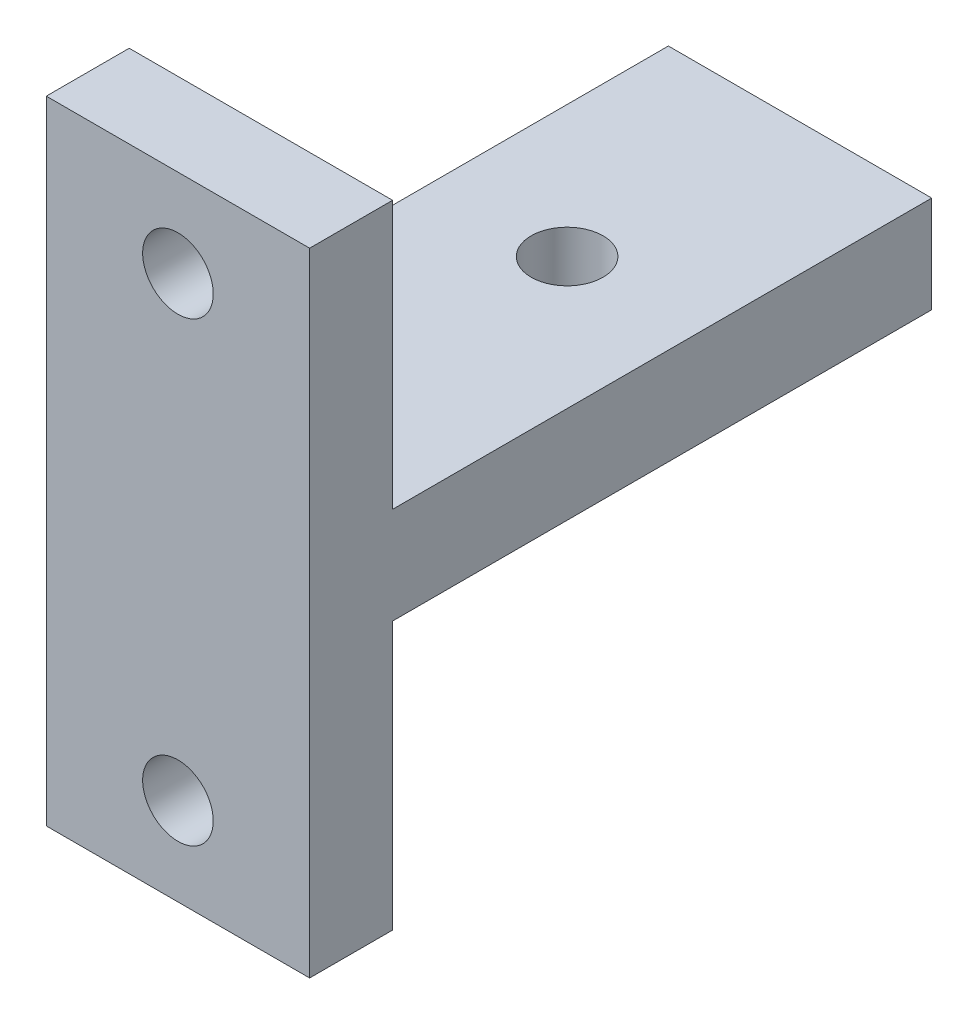
ISO-10303-21;
HEADER;
FILE_DESCRIPTION(('STEP AP214'),'2;1');
FILE_NAME('part.step','',(''),(''),'','','');
FILE_SCHEMA(('AUTOMOTIVE_DESIGN { 1 0 10303 214 1 1 1 1 }'));
ENDSEC;
DATA;
#1=APPLICATION_CONTEXT('core data for automotive mechanical design processes');
#2=APPLICATION_PROTOCOL_DEFINITION('international standard','automotive_design',2000,#1);
#3=PRODUCT_CONTEXT('',#1,'mechanical');
#4=PRODUCT('Part','Part','',(#3));
#5=PRODUCT_RELATED_PRODUCT_CATEGORY('part','',(#4));
#6=PRODUCT_DEFINITION_FORMATION('','',#4);
#7=PRODUCT_DEFINITION_CONTEXT('part definition',#1,'design');
#8=PRODUCT_DEFINITION('design','',#6,#7);
#9=PRODUCT_DEFINITION_SHAPE('','',#8);
#10=(LENGTH_UNIT() NAMED_UNIT(*) SI_UNIT(.MILLI.,.METRE.));
#11=(NAMED_UNIT(*) PLANE_ANGLE_UNIT() SI_UNIT($,.RADIAN.));
#12=(NAMED_UNIT(*) SI_UNIT($,.STERADIAN.) SOLID_ANGLE_UNIT());
#13=UNCERTAINTY_MEASURE_WITH_UNIT(LENGTH_MEASURE(1.E-05),#10,'distance_accuracy_value','');
#14=(GEOMETRIC_REPRESENTATION_CONTEXT(3) GLOBAL_UNCERTAINTY_ASSIGNED_CONTEXT((#13)) GLOBAL_UNIT_ASSIGNED_CONTEXT((#10,
#11,#12)) REPRESENTATION_CONTEXT('',''));
#15=CARTESIAN_POINT('',(0.,0.,0.));
#16=DIRECTION('',(0.,0.,1.));
#17=DIRECTION('',(1.,0.,0.));
#18=AXIS2_PLACEMENT_3D('',#15,#16,#17);
#19=CARTESIAN_POINT('',(0.,0.,-6.));
#20=DIRECTION('',(0.,0.,1.));
#21=DIRECTION('',(1.,0.,0.));
#22=AXIS2_PLACEMENT_3D('',#19,#20,#21);
#23=PLANE('',#22);
#24=CARTESIAN_POINT('',(0.,-16.51,-6.));
#25=DIRECTION('',(0.,0.,1.));
#26=DIRECTION('',(1.,0.,0.));
#27=AXIS2_PLACEMENT_3D('',#24,#25,#26);
#28=CIRCLE('',#27,2.5527);
#29=CARTESIAN_POINT('',(2.55269999999999,-16.51,-6.));
#30=VERTEX_POINT('',#29);
#31=EDGE_CURVE('E170',#30,#30,#28,.F.);
#32=ORIENTED_EDGE('',*,*,#31,.F.);
#33=EDGE_LOOP('',(#32));
#34=FACE_BOUND('',#33,.T.);
#35=DIRECTION('',(0.,1.,0.));
#36=VECTOR('',#35,1.);
#37=CARTESIAN_POINT('',(-9.525,0.,-6.));
#38=LINE('',#37,#36);
#39=CARTESIAN_POINT('',(-9.525,-22.86,-6.));
#40=VERTEX_POINT('',#39);
#41=CARTESIAN_POINT('',(-9.525,-3.5,-6.00000000000001));
#42=VERTEX_POINT('',#41);
#43=EDGE_CURVE('E160',#40,#42,#38,.T.);
#44=ORIENTED_EDGE('',*,*,#43,.T.);
#45=DIRECTION('',(1.,0.,0.));
#46=VECTOR('',#45,1.);
#47=CARTESIAN_POINT('',(0.,-3.5,-6.));
#48=LINE('',#47,#46);
#49=CARTESIAN_POINT('',(9.525,-3.5,-6.00000000000001));
#50=VERTEX_POINT('',#49);
#51=EDGE_CURVE('E152',#42,#50,#48,.T.);
#52=ORIENTED_EDGE('',*,*,#51,.T.);
#53=DIRECTION('',(0.,1.,0.));
#54=VECTOR('',#53,1.);
#55=CARTESIAN_POINT('',(9.525,0.,-6.));
#56=LINE('',#55,#54);
#57=CARTESIAN_POINT('',(9.525,-22.86,-6.));
#58=VERTEX_POINT('',#57);
#59=EDGE_CURVE('E166',#58,#50,#56,.T.);
#60=ORIENTED_EDGE('',*,*,#59,.F.);
#61=DIRECTION('',(1.,0.,0.));
#62=VECTOR('',#61,1.);
#63=CARTESIAN_POINT('',(0.,-22.86,-6.));
#64=LINE('',#63,#62);
#65=EDGE_CURVE('E163',#40,#58,#64,.T.);
#66=ORIENTED_EDGE('',*,*,#65,.F.);
#67=EDGE_LOOP('',(#44,#52,#60,#66));
#68=FACE_BOUND('',#67,.T.);
#69=ADVANCED_FACE('F38',(#34,#68),#23,.F.);
#70=CARTESIAN_POINT('',(-9.525,0.,-6.));
#71=DIRECTION('',(1.,0.,0.));
#72=DIRECTION('',(0.,0.,-1.));
#73=AXIS2_PLACEMENT_3D('',#70,#71,#72);
#74=PLANE('',#73);
#75=CARTESIAN_POINT('',(-9.525,3.5,-6.));
#76=VERTEX_POINT('',#75);
#77=CARTESIAN_POINT('',(-9.525,22.86,-6.));
#78=VERTEX_POINT('',#77);
#79=EDGE_CURVE('E63',#76,#78,#38,.T.);
#80=ORIENTED_EDGE('',*,*,#79,.F.);
#81=DIRECTION('',(0.,0.,1.));
#82=VECTOR('',#81,1.);
#83=CARTESIAN_POINT('',(-9.525,3.5,-45.));
#84=LINE('',#83,#82);
#85=CARTESIAN_POINT('',(-9.525,3.5,-45.));
#86=VERTEX_POINT('',#85);
#87=EDGE_CURVE('E55',#86,#76,#84,.T.);
#88=ORIENTED_EDGE('',*,*,#87,.F.);
#89=DIRECTION('',(0.,-1.,0.));
#90=VECTOR('',#89,1.);
#91=CARTESIAN_POINT('',(-9.525,-3.5,-45.));
#92=LINE('',#91,#90);
#93=CARTESIAN_POINT('',(-9.525,-3.5,-45.));
#94=VERTEX_POINT('',#93);
#95=EDGE_CURVE('E131',#86,#94,#92,.T.);
#96=ORIENTED_EDGE('',*,*,#95,.T.);
#97=DIRECTION('',(0.,0.,1.));
#98=VECTOR('',#97,1.);
#99=CARTESIAN_POINT('',(-9.525,-3.5,-45.));
#100=LINE('',#99,#98);
#101=EDGE_CURVE('E147',#94,#42,#100,.T.);
#102=ORIENTED_EDGE('',*,*,#101,.T.);
#103=ORIENTED_EDGE('',*,*,#43,.F.);
#104=DIRECTION('',(0.,0.,1.));
#105=VECTOR('',#104,1.);
#106=CARTESIAN_POINT('',(-9.525,-22.86,-6.));
#107=LINE('',#106,#105);
#108=CARTESIAN_POINT('',(-9.525,-22.86,0.));
#109=VERTEX_POINT('',#108);
#110=EDGE_CURVE('E42',#40,#109,#107,.T.);
#111=ORIENTED_EDGE('',*,*,#110,.T.);
#112=DIRECTION('',(0.,1.,0.));
#113=VECTOR('',#112,1.);
#114=CARTESIAN_POINT('',(-9.525,0.,0.));
#115=LINE('',#114,#113);
#116=CARTESIAN_POINT('',(-9.525,22.86,0.));
#117=VERTEX_POINT('',#116);
#118=EDGE_CURVE('E85',#109,#117,#115,.T.);
#119=ORIENTED_EDGE('',*,*,#118,.T.);
#120=DIRECTION('',(0.,0.,1.));
#121=VECTOR('',#120,1.);
#122=CARTESIAN_POINT('',(-9.525,22.86,-6.));
#123=LINE('',#122,#121);
#124=EDGE_CURVE('E11',#78,#117,#123,.T.);
#125=ORIENTED_EDGE('',*,*,#124,.F.);
#126=EDGE_LOOP('',(#80,#88,#96,#102,#103,#111,#119,#125));
#127=FACE_BOUND('',#126,.T.);
#128=ADVANCED_FACE('F188',(#127),#74,.F.);
#129=CARTESIAN_POINT('',(0.,22.86,-6.));
#130=DIRECTION('',(0.,-1.,0.));
#131=DIRECTION('',(0.,0.,-1.));
#132=AXIS2_PLACEMENT_3D('',#129,#130,#131);
#133=PLANE('',#132);
#134=DIRECTION('',(1.,0.,0.));
#135=VECTOR('',#134,1.);
#136=CARTESIAN_POINT('',(0.,22.86,0.));
#137=LINE('',#136,#135);
#138=CARTESIAN_POINT('',(9.525,22.86,0.));
#139=VERTEX_POINT('',#138);
#140=EDGE_CURVE('E181',#117,#139,#137,.T.);
#141=ORIENTED_EDGE('',*,*,#140,.T.);
#142=DIRECTION('',(0.,0.,1.));
#143=VECTOR('',#142,1.);
#144=CARTESIAN_POINT('',(9.525,22.86,-6.));
#145=LINE('',#144,#143);
#146=CARTESIAN_POINT('',(9.525,22.86,-6.));
#147=VERTEX_POINT('',#146);
#148=EDGE_CURVE('E47',#147,#139,#145,.T.);
#149=ORIENTED_EDGE('',*,*,#148,.F.);
#150=DIRECTION('',(1.,0.,0.));
#151=VECTOR('',#150,1.);
#152=CARTESIAN_POINT('',(0.,22.86,-6.));
#153=LINE('',#152,#151);
#154=EDGE_CURVE('E168',#78,#147,#153,.T.);
#155=ORIENTED_EDGE('',*,*,#154,.F.);
#156=ORIENTED_EDGE('',*,*,#124,.T.);
#157=EDGE_LOOP('',(#141,#149,#155,#156));
#158=FACE_BOUND('',#157,.T.);
#159=ADVANCED_FACE('F202',(#158),#133,.F.);
#160=CARTESIAN_POINT('',(9.525,0.,-6.));
#161=DIRECTION('',(1.,0.,0.));
#162=DIRECTION('',(0.,0.,-1.));
#163=AXIS2_PLACEMENT_3D('',#160,#161,#162);
#164=PLANE('',#163);
#165=ORIENTED_EDGE('',*,*,#148,.T.);
#166=DIRECTION('',(0.,1.,0.));
#167=VECTOR('',#166,1.);
#168=CARTESIAN_POINT('',(9.525,0.,0.));
#169=LINE('',#168,#167);
#170=CARTESIAN_POINT('',(9.525,-22.86,0.));
#171=VERTEX_POINT('',#170);
#172=EDGE_CURVE('E179',#171,#139,#169,.T.);
#173=ORIENTED_EDGE('',*,*,#172,.F.);
#174=DIRECTION('',(0.,0.,1.));
#175=VECTOR('',#174,1.);
#176=CARTESIAN_POINT('',(9.525,-22.86,-6.));
#177=LINE('',#176,#175);
#178=EDGE_CURVE('E186',#58,#171,#177,.T.);
#179=ORIENTED_EDGE('',*,*,#178,.F.);
#180=ORIENTED_EDGE('',*,*,#59,.T.);
#181=DIRECTION('',(0.,0.,1.));
#182=VECTOR('',#181,1.);
#183=CARTESIAN_POINT('',(9.525,-3.5,-45.));
#184=LINE('',#183,#182);
#185=CARTESIAN_POINT('',(9.525,-3.5,-45.));
#186=VERTEX_POINT('',#185);
#187=EDGE_CURVE('E136',#186,#50,#184,.T.);
#188=ORIENTED_EDGE('',*,*,#187,.F.);
#189=DIRECTION('',(0.,1.,0.));
#190=VECTOR('',#189,1.);
#191=CARTESIAN_POINT('',(9.525,-3.5,-45.));
#192=LINE('',#191,#190);
#193=CARTESIAN_POINT('',(9.525,3.5,-45.));
#194=VERTEX_POINT('',#193);
#195=EDGE_CURVE('E128',#186,#194,#192,.T.);
#196=ORIENTED_EDGE('',*,*,#195,.T.);
#197=DIRECTION('',(0.,0.,1.));
#198=VECTOR('',#197,1.);
#199=CARTESIAN_POINT('',(9.525,3.5,-45.));
#200=LINE('',#199,#198);
#201=CARTESIAN_POINT('',(9.525,3.5,-6.00000000000001));
#202=VERTEX_POINT('',#201);
#203=EDGE_CURVE('E113',#194,#202,#200,.T.);
#204=ORIENTED_EDGE('',*,*,#203,.T.);
#205=EDGE_CURVE('E165',#202,#147,#56,.T.);
#206=ORIENTED_EDGE('',*,*,#205,.T.);
#207=EDGE_LOOP('',(#165,#173,#179,#180,#188,#196,#204,#206));
#208=FACE_BOUND('',#207,.T.);
#209=ADVANCED_FACE('F134',(#208),#164,.T.);
#210=CARTESIAN_POINT('',(0.,-22.86,-6.));
#211=DIRECTION('',(0.,-1.,0.));
#212=DIRECTION('',(0.,0.,-1.));
#213=AXIS2_PLACEMENT_3D('',#210,#211,#212);
#214=PLANE('',#213);
#215=DIRECTION('',(1.,0.,0.));
#216=VECTOR('',#215,1.);
#217=CARTESIAN_POINT('',(0.,-22.86,0.));
#218=LINE('',#217,#216);
#219=EDGE_CURVE('E176',#109,#171,#218,.T.);
#220=ORIENTED_EDGE('',*,*,#219,.F.);
#221=ORIENTED_EDGE('',*,*,#110,.F.);
#222=ORIENTED_EDGE('',*,*,#65,.T.);
#223=ORIENTED_EDGE('',*,*,#178,.T.);
#224=EDGE_LOOP('',(#220,#221,#222,#223));
#225=FACE_BOUND('',#224,.T.);
#226=ADVANCED_FACE('F193',(#225),#214,.T.);
#227=CARTESIAN_POINT('',(0.,16.51,-6.));
#228=DIRECTION('',(0.,0.,1.));
#229=DIRECTION('',(1.,0.,0.));
#230=AXIS2_PLACEMENT_3D('',#227,#228,#229);
#231=CYLINDRICAL_SURFACE('',#230,2.5527);
#232=CARTESIAN_POINT('',(0.,16.51,-6.));
#233=DIRECTION('',(0.,0.,1.));
#234=DIRECTION('',(1.,0.,0.));
#235=AXIS2_PLACEMENT_3D('',#232,#233,#234);
#236=CIRCLE('',#235,2.5527);
#237=CARTESIAN_POINT('',(2.55269999999999,16.51,-6.));
#238=VERTEX_POINT('',#237);
#239=EDGE_CURVE('E156',#238,#238,#236,.T.);
#240=ORIENTED_EDGE('',*,*,#239,.F.);
#241=EDGE_LOOP('',(#240));
#242=FACE_BOUND('',#241,.T.);
#243=CARTESIAN_POINT('',(0.,16.51,0.));
#244=DIRECTION('',(0.,0.,1.));
#245=DIRECTION('',(1.,0.,0.));
#246=AXIS2_PLACEMENT_3D('',#243,#244,#245);
#247=CIRCLE('',#246,2.5527);
#248=CARTESIAN_POINT('',(2.55269999999999,16.51,0.));
#249=VERTEX_POINT('',#248);
#250=EDGE_CURVE('E155',#249,#249,#247,.T.);
#251=ORIENTED_EDGE('',*,*,#250,.T.);
#252=EDGE_LOOP('',(#251));
#253=FACE_BOUND('',#252,.T.);
#254=ADVANCED_FACE('F40',(#242,#253),#231,.F.);
#255=CARTESIAN_POINT('',(0.,-16.51,-6.));
#256=DIRECTION('',(0.,0.,1.));
#257=DIRECTION('',(1.,0.,0.));
#258=AXIS2_PLACEMENT_3D('',#255,#256,#257);
#259=CYLINDRICAL_SURFACE('',#258,2.5527);
#260=ORIENTED_EDGE('',*,*,#31,.T.);
#261=EDGE_LOOP('',(#260));
#262=FACE_BOUND('',#261,.T.);
#263=CARTESIAN_POINT('',(0.,-16.51,0.));
#264=DIRECTION('',(0.,0.,1.));
#265=DIRECTION('',(1.,0.,0.));
#266=AXIS2_PLACEMENT_3D('',#263,#264,#265);
#267=CIRCLE('',#266,2.5527);
#268=CARTESIAN_POINT('',(2.55269999999999,-16.51,0.));
#269=VERTEX_POINT('',#268);
#270=EDGE_CURVE('E159',#269,#269,#267,.F.);
#271=ORIENTED_EDGE('',*,*,#270,.F.);
#272=EDGE_LOOP('',(#271));
#273=FACE_BOUND('',#272,.T.);
#274=ADVANCED_FACE('F200',(#262,#273),#259,.F.);
#275=ORIENTED_EDGE('',*,*,#239,.T.);
#276=EDGE_LOOP('',(#275));
#277=FACE_BOUND('',#276,.T.);
#278=ORIENTED_EDGE('',*,*,#205,.F.);
#279=DIRECTION('',(-1.,0.,0.));
#280=VECTOR('',#279,1.);
#281=CARTESIAN_POINT('',(0.,3.5,-6.));
#282=LINE('',#281,#280);
#283=EDGE_CURVE('E117',#202,#76,#282,.T.);
#284=ORIENTED_EDGE('',*,*,#283,.T.);
#285=ORIENTED_EDGE('',*,*,#79,.T.);
#286=ORIENTED_EDGE('',*,*,#154,.T.);
#287=EDGE_LOOP('',(#278,#284,#285,#286));
#288=FACE_BOUND('',#287,.T.);
#289=ADVANCED_FACE('F207',(#277,#288),#23,.F.);
#290=CARTESIAN_POINT('',(0.,0.,0.));
#291=DIRECTION('',(0.,0.,1.));
#292=DIRECTION('',(1.,0.,0.));
#293=AXIS2_PLACEMENT_3D('',#290,#291,#292);
#294=PLANE('',#293);
#295=ORIENTED_EDGE('',*,*,#140,.F.);
#296=ORIENTED_EDGE('',*,*,#118,.F.);
#297=ORIENTED_EDGE('',*,*,#219,.T.);
#298=ORIENTED_EDGE('',*,*,#172,.T.);
#299=EDGE_LOOP('',(#295,#296,#297,#298));
#300=FACE_BOUND('',#299,.T.);
#301=ORIENTED_EDGE('',*,*,#250,.F.);
#302=EDGE_LOOP('',(#301));
#303=FACE_BOUND('',#302,.T.);
#304=ORIENTED_EDGE('',*,*,#270,.T.);
#305=EDGE_LOOP('',(#304));
#306=FACE_BOUND('',#305,.T.);
#307=ADVANCED_FACE('F191',(#300,#303,#306),#294,.T.);
#308=CARTESIAN_POINT('',(-9.525,-3.5,-45.));
#309=DIRECTION('',(0.,-1.,0.));
#310=DIRECTION('',(0.,0.,-1.));
#311=AXIS2_PLACEMENT_3D('',#308,#309,#310);
#312=PLANE('',#311);
#313=CARTESIAN_POINT('',(0.,-3.5,-28.15));
#314=DIRECTION('',(0.,-1.,0.));
#315=DIRECTION('',(0.,0.,-1.));
#316=AXIS2_PLACEMENT_3D('',#313,#314,#315);
#317=CIRCLE('',#316,2.6);
#318=CARTESIAN_POINT('',(0.,-3.5,-30.75));
#319=VERTEX_POINT('',#318);
#320=EDGE_CURVE('E137',#319,#319,#317,.T.);
#321=ORIENTED_EDGE('',*,*,#320,.F.);
#322=EDGE_LOOP('',(#321));
#323=FACE_BOUND('',#322,.T.);
#324=ORIENTED_EDGE('',*,*,#51,.F.);
#325=ORIENTED_EDGE('',*,*,#101,.F.);
#326=DIRECTION('',(1.,0.,0.));
#327=VECTOR('',#326,1.);
#328=CARTESIAN_POINT('',(-9.525,-3.5,-45.));
#329=LINE('',#328,#327);
#330=EDGE_CURVE('E121',#94,#186,#329,.T.);
#331=ORIENTED_EDGE('',*,*,#330,.T.);
#332=ORIENTED_EDGE('',*,*,#187,.T.);
#333=EDGE_LOOP('',(#324,#325,#331,#332));
#334=FACE_BOUND('',#333,.T.);
#335=ADVANCED_FACE('F221',(#323,#334),#312,.T.);
#336=CARTESIAN_POINT('',(-9.525,3.5,-45.));
#337=DIRECTION('',(0.,1.,0.));
#338=DIRECTION('',(0.,0.,1.));
#339=AXIS2_PLACEMENT_3D('',#336,#337,#338);
#340=PLANE('',#339);
#341=CARTESIAN_POINT('',(0.,3.5,-28.15));
#342=DIRECTION('',(0.,1.,0.));
#343=DIRECTION('',(0.,0.,1.));
#344=AXIS2_PLACEMENT_3D('',#341,#342,#343);
#345=CIRCLE('',#344,2.6);
#346=CARTESIAN_POINT('',(0.,3.5,-25.55));
#347=VERTEX_POINT('',#346);
#348=EDGE_CURVE('E140',#347,#347,#345,.T.);
#349=ORIENTED_EDGE('',*,*,#348,.F.);
#350=EDGE_LOOP('',(#349));
#351=FACE_BOUND('',#350,.T.);
#352=ORIENTED_EDGE('',*,*,#283,.F.);
#353=ORIENTED_EDGE('',*,*,#203,.F.);
#354=DIRECTION('',(-1.,0.,0.));
#355=VECTOR('',#354,1.);
#356=CARTESIAN_POINT('',(-9.525,3.5,-45.));
#357=LINE('',#356,#355);
#358=EDGE_CURVE('E116',#194,#86,#357,.T.);
#359=ORIENTED_EDGE('',*,*,#358,.T.);
#360=ORIENTED_EDGE('',*,*,#87,.T.);
#361=EDGE_LOOP('',(#352,#353,#359,#360));
#362=FACE_BOUND('',#361,.T.);
#363=ADVANCED_FACE('F115',(#351,#362),#340,.T.);
#364=CARTESIAN_POINT('',(0.,0.,-45.));
#365=DIRECTION('',(0.,0.,-1.));
#366=DIRECTION('',(-1.,0.,0.));
#367=AXIS2_PLACEMENT_3D('',#364,#365,#366);
#368=PLANE('',#367);
#369=ORIENTED_EDGE('',*,*,#195,.F.);
#370=ORIENTED_EDGE('',*,*,#330,.F.);
#371=ORIENTED_EDGE('',*,*,#95,.F.);
#372=ORIENTED_EDGE('',*,*,#358,.F.);
#373=EDGE_LOOP('',(#369,#370,#371,#372));
#374=FACE_BOUND('',#373,.T.);
#375=ADVANCED_FACE('F126',(#374),#368,.T.);
#376=CARTESIAN_POINT('',(0.,-22.86,-28.15));
#377=DIRECTION('',(0.,1.,0.));
#378=DIRECTION('',(0.,0.,1.));
#379=AXIS2_PLACEMENT_3D('',#376,#377,#378);
#380=CYLINDRICAL_SURFACE('',#379,2.6);
#381=ORIENTED_EDGE('',*,*,#320,.T.);
#382=EDGE_LOOP('',(#381));
#383=FACE_BOUND('',#382,.T.);
#384=ORIENTED_EDGE('',*,*,#348,.T.);
#385=EDGE_LOOP('',(#384));
#386=FACE_BOUND('',#385,.T.);
#387=ADVANCED_FACE('F240',(#383,#386),#380,.F.);
#388=CLOSED_SHELL('',(#69,#128,#159,#209,#226,#254,#274,#289,#307,#335,#363,#375,#387));
#389=MANIFOLD_SOLID_BREP('B2',#388);
#390=ADVANCED_BREP_SHAPE_REPRESENTATION('',(#18,#389),#14);
#391=SHAPE_DEFINITION_REPRESENTATION(#9,#390);
ENDSEC;
END-ISO-10303-21;
